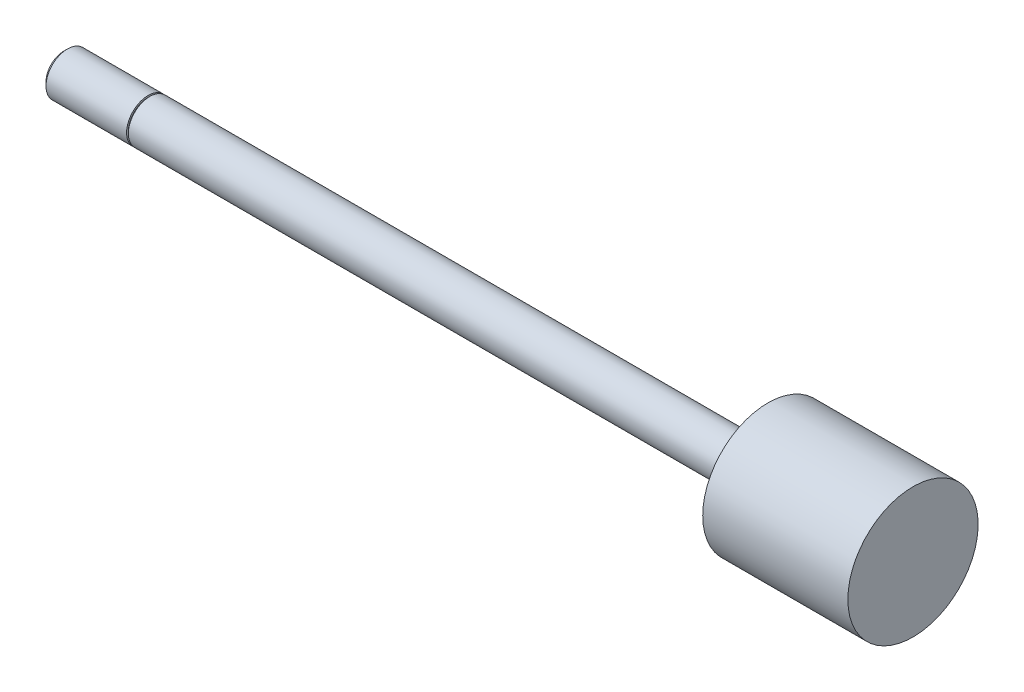
ISO-10303-21;
HEADER;
FILE_DESCRIPTION(('STEP AP214'),'2;1');
FILE_NAME('part.step','',(''),(''),'','','');
FILE_SCHEMA(('AUTOMOTIVE_DESIGN { 1 0 10303 214 1 1 1 1 }'));
ENDSEC;
DATA;
#1=APPLICATION_CONTEXT('core data for automotive mechanical design processes');
#2=APPLICATION_PROTOCOL_DEFINITION('international standard','automotive_design',2000,#1);
#3=PRODUCT_CONTEXT('',#1,'mechanical');
#4=PRODUCT('Part','Part','',(#3));
#5=PRODUCT_RELATED_PRODUCT_CATEGORY('part','',(#4));
#6=PRODUCT_DEFINITION_FORMATION('','',#4);
#7=PRODUCT_DEFINITION_CONTEXT('part definition',#1,'design');
#8=PRODUCT_DEFINITION('design','',#6,#7);
#9=PRODUCT_DEFINITION_SHAPE('','',#8);
#10=(LENGTH_UNIT() NAMED_UNIT(*) SI_UNIT(.MILLI.,.METRE.));
#11=(NAMED_UNIT(*) PLANE_ANGLE_UNIT() SI_UNIT($,.RADIAN.));
#12=(NAMED_UNIT(*) SI_UNIT($,.STERADIAN.) SOLID_ANGLE_UNIT());
#13=UNCERTAINTY_MEASURE_WITH_UNIT(LENGTH_MEASURE(1.E-05),#10,'distance_accuracy_value','');
#14=(GEOMETRIC_REPRESENTATION_CONTEXT(3) GLOBAL_UNCERTAINTY_ASSIGNED_CONTEXT((#13)) GLOBAL_UNIT_ASSIGNED_CONTEXT((#10,
#11,#12)) REPRESENTATION_CONTEXT('',''));
#15=CARTESIAN_POINT('',(0.,0.,0.));
#16=DIRECTION('',(0.,0.,1.));
#17=DIRECTION('',(1.,0.,0.));
#18=AXIS2_PLACEMENT_3D('',#15,#16,#17);
#19=CARTESIAN_POINT('',(112.7252,0.,0.));
#20=DIRECTION('',(-1.,0.,0.));
#21=DIRECTION('',(0.,0.,1.));
#22=AXIS2_PLACEMENT_3D('',#19,#20,#21);
#23=CYLINDRICAL_SURFACE('',#22,3.175);
#24=CARTESIAN_POINT('',(91.2876,0.,0.));
#25=DIRECTION('',(-1.,0.,0.));
#26=DIRECTION('',(0.,0.,1.));
#27=AXIS2_PLACEMENT_3D('',#24,#25,#26);
#28=CIRCLE('',#27,3.175);
#29=CARTESIAN_POINT('',(91.2876,0.,3.175));
#30=VERTEX_POINT('',#29);
#31=EDGE_CURVE('E10',#30,#30,#28,.T.);
#32=ORIENTED_EDGE('',*,*,#31,.T.);
#33=EDGE_LOOP('',(#32));
#34=FACE_BOUND('',#33,.T.);
#35=CARTESIAN_POINT('',(0.,0.,0.));
#36=DIRECTION('',(-1.,0.,0.));
#37=DIRECTION('',(0.,0.,1.));
#38=AXIS2_PLACEMENT_3D('',#35,#36,#37);
#39=CIRCLE('',#38,3.175);
#40=CARTESIAN_POINT('',(0.,0.,3.175));
#41=VERTEX_POINT('',#40);
#42=EDGE_CURVE('E50',#41,#41,#39,.T.);
#43=ORIENTED_EDGE('',*,*,#42,.F.);
#44=EDGE_LOOP('',(#43));
#45=FACE_BOUND('',#44,.T.);
#46=ADVANCED_FACE('F34',(#34,#45),#23,.T.);
#47=CARTESIAN_POINT('',(91.2876,3.175,0.));
#48=DIRECTION('',(1.,0.,0.));
#49=DIRECTION('',(0.,0.,-1.));
#50=AXIS2_PLACEMENT_3D('',#47,#48,#49);
#51=PLANE('',#50);
#52=ORIENTED_EDGE('',*,*,#31,.F.);
#53=EDGE_LOOP('',(#52));
#54=FACE_BOUND('',#53,.T.);
#55=CARTESIAN_POINT('',(91.2876,0.,0.));
#56=DIRECTION('',(-1.,0.,0.));
#57=DIRECTION('',(0.,0.,1.));
#58=AXIS2_PLACEMENT_3D('',#55,#56,#57);
#59=CIRCLE('',#58,9.62025);
#60=CARTESIAN_POINT('',(91.2876,0.,9.62025));
#61=VERTEX_POINT('',#60);
#62=EDGE_CURVE('E42',#61,#61,#59,.T.);
#63=ORIENTED_EDGE('',*,*,#62,.T.);
#64=EDGE_LOOP('',(#63));
#65=FACE_BOUND('',#64,.T.);
#66=ADVANCED_FACE('F84',(#54,#65),#51,.F.);
#67=CARTESIAN_POINT('',(112.7252,0.,0.));
#68=DIRECTION('',(-1.,0.,0.));
#69=DIRECTION('',(0.,0.,1.));
#70=AXIS2_PLACEMENT_3D('',#67,#68,#69);
#71=CYLINDRICAL_SURFACE('',#70,9.62025);
#72=ORIENTED_EDGE('',*,*,#62,.F.);
#73=EDGE_LOOP('',(#72));
#74=FACE_BOUND('',#73,.T.);
#75=CARTESIAN_POINT('',(112.7252,0.,0.));
#76=DIRECTION('',(-1.,0.,0.));
#77=DIRECTION('',(0.,0.,1.));
#78=AXIS2_PLACEMENT_3D('',#75,#76,#77);
#79=CIRCLE('',#78,9.62025);
#80=CARTESIAN_POINT('',(112.7252,0.,9.62025));
#81=VERTEX_POINT('',#80);
#82=EDGE_CURVE('E47',#81,#81,#79,.T.);
#83=ORIENTED_EDGE('',*,*,#82,.T.);
#84=EDGE_LOOP('',(#83));
#85=FACE_BOUND('',#84,.T.);
#86=ADVANCED_FACE('F72',(#74,#85),#71,.T.);
#87=CARTESIAN_POINT('',(112.7252,9.62025,0.));
#88=DIRECTION('',(-1.,0.,0.));
#89=DIRECTION('',(0.,0.,1.));
#90=AXIS2_PLACEMENT_3D('',#87,#88,#89);
#91=PLANE('',#90);
#92=ORIENTED_EDGE('',*,*,#82,.F.);
#93=EDGE_LOOP('',(#92));
#94=FACE_BOUND('',#93,.T.);
#95=ADVANCED_FACE('F74',(#94),#91,.F.);
#96=CARTESIAN_POINT('',(-0.254,3.429,0.));
#97=DIRECTION('',(1.,0.,0.));
#98=DIRECTION('',(0.,0.,-1.));
#99=AXIS2_PLACEMENT_3D('',#96,#97,#98);
#100=PLANE('',#99);
#101=CARTESIAN_POINT('',(-0.254,0.,0.));
#102=DIRECTION('',(-1.,0.,0.));
#103=DIRECTION('',(0.,0.,1.));
#104=AXIS2_PLACEMENT_3D('',#101,#102,#103);
#105=CIRCLE('',#104,2.921);
#106=CARTESIAN_POINT('',(-0.254,0.,2.921));
#107=VERTEX_POINT('',#106);
#108=EDGE_CURVE('E52',#107,#107,#105,.T.);
#109=ORIENTED_EDGE('',*,*,#108,.T.);
#110=EDGE_LOOP('',(#109));
#111=FACE_BOUND('',#110,.T.);
#112=CARTESIAN_POINT('',(-0.254000000000004,0.,0.));
#113=DIRECTION('',(1.,0.,0.));
#114=DIRECTION('',(0.,0.,-1.));
#115=AXIS2_PLACEMENT_3D('',#112,#113,#114);
#116=CIRCLE('',#115,3.175);
#117=CARTESIAN_POINT('',(-0.254000000000004,0.,-3.175));
#118=VERTEX_POINT('',#117);
#119=EDGE_CURVE('E38',#118,#118,#116,.T.);
#120=ORIENTED_EDGE('',*,*,#119,.T.);
#121=EDGE_LOOP('',(#120));
#122=FACE_BOUND('',#121,.T.);
#123=ADVANCED_FACE('F76',(#111,#122),#100,.T.);
#124=CARTESIAN_POINT('',(0.,2.921,0.));
#125=DIRECTION('',(-1.,0.,0.));
#126=DIRECTION('',(0.,0.,1.));
#127=AXIS2_PLACEMENT_3D('',#124,#125,#126);
#128=PLANE('',#127);
#129=CARTESIAN_POINT('',(0.,0.,0.));
#130=DIRECTION('',(-1.,0.,0.));
#131=DIRECTION('',(0.,0.,1.));
#132=AXIS2_PLACEMENT_3D('',#129,#130,#131);
#133=CIRCLE('',#132,2.921);
#134=CARTESIAN_POINT('',(0.,0.,2.921));
#135=VERTEX_POINT('',#134);
#136=EDGE_CURVE('E58',#135,#135,#133,.T.);
#137=ORIENTED_EDGE('',*,*,#136,.F.);
#138=EDGE_LOOP('',(#137));
#139=FACE_BOUND('',#138,.T.);
#140=ORIENTED_EDGE('',*,*,#42,.T.);
#141=EDGE_LOOP('',(#140));
#142=FACE_BOUND('',#141,.T.);
#143=ADVANCED_FACE('F82',(#139,#142),#128,.T.);
#144=CARTESIAN_POINT('',(0.,0.,0.));
#145=DIRECTION('',(-1.,0.,0.));
#146=DIRECTION('',(0.,0.,1.));
#147=AXIS2_PLACEMENT_3D('',#144,#145,#146);
#148=CYLINDRICAL_SURFACE('',#147,2.921);
#149=ORIENTED_EDGE('',*,*,#136,.T.);
#150=EDGE_LOOP('',(#149));
#151=FACE_BOUND('',#150,.T.);
#152=ORIENTED_EDGE('',*,*,#108,.F.);
#153=EDGE_LOOP('',(#152));
#154=FACE_BOUND('',#153,.T.);
#155=ADVANCED_FACE('F111',(#151,#154),#148,.T.);
#156=CARTESIAN_POINT('',(-12.7,0.,0.));
#157=DIRECTION('',(1.,0.,0.));
#158=DIRECTION('',(0.,0.,-1.));
#159=AXIS2_PLACEMENT_3D('',#156,#157,#158);
#160=PLANE('',#159);
#161=CARTESIAN_POINT('',(-12.7,0.,0.));
#162=DIRECTION('',(-1.,0.,0.));
#163=DIRECTION('',(0.,0.,1.));
#164=AXIS2_PLACEMENT_3D('',#161,#162,#163);
#165=CIRCLE('',#164,2.63398);
#166=CARTESIAN_POINT('',(-12.7,0.,2.63398));
#167=VERTEX_POINT('',#166);
#168=EDGE_CURVE('E67',#167,#167,#165,.T.);
#169=ORIENTED_EDGE('',*,*,#168,.T.);
#170=EDGE_LOOP('',(#169));
#171=FACE_BOUND('',#170,.T.);
#172=ADVANCED_FACE('F100',(#171),#160,.F.);
#173=CARTESIAN_POINT('',(-12.15898,0.,0.));
#174=DIRECTION('',(1.,0.,0.));
#175=DIRECTION('',(0.,0.,-1.));
#176=AXIS2_PLACEMENT_3D('',#173,#174,#175);
#177=CONICAL_SURFACE('',#176,3.175,0.785398163397448);
#178=ORIENTED_EDGE('',*,*,#168,.F.);
#179=EDGE_LOOP('',(#178));
#180=FACE_BOUND('',#179,.T.);
#181=CARTESIAN_POINT('',(-12.15898,0.,0.));
#182=DIRECTION('',(-1.,0.,0.));
#183=DIRECTION('',(0.,0.,1.));
#184=AXIS2_PLACEMENT_3D('',#181,#182,#183);
#185=CIRCLE('',#184,3.175);
#186=CARTESIAN_POINT('',(-12.15898,0.,3.175));
#187=VERTEX_POINT('',#186);
#188=EDGE_CURVE('E56',#187,#187,#185,.T.);
#189=ORIENTED_EDGE('',*,*,#188,.T.);
#190=EDGE_LOOP('',(#189));
#191=FACE_BOUND('',#190,.T.);
#192=ADVANCED_FACE('F95',(#180,#191),#177,.T.);
#193=ORIENTED_EDGE('',*,*,#188,.F.);
#194=EDGE_LOOP('',(#193));
#195=FACE_BOUND('',#194,.T.);
#196=ORIENTED_EDGE('',*,*,#119,.F.);
#197=EDGE_LOOP('',(#196));
#198=FACE_BOUND('',#197,.T.);
#199=ADVANCED_FACE('F36',(#195,#198),#23,.T.);
#200=CLOSED_SHELL('',(#46,#66,#86,#95,#123,#143,#155,#172,#192,#199));
#201=MANIFOLD_SOLID_BREP('B2',#200);
#202=ADVANCED_BREP_SHAPE_REPRESENTATION('',(#18,#201),#14);
#203=SHAPE_DEFINITION_REPRESENTATION(#9,#202);
ENDSEC;
END-ISO-10303-21;
